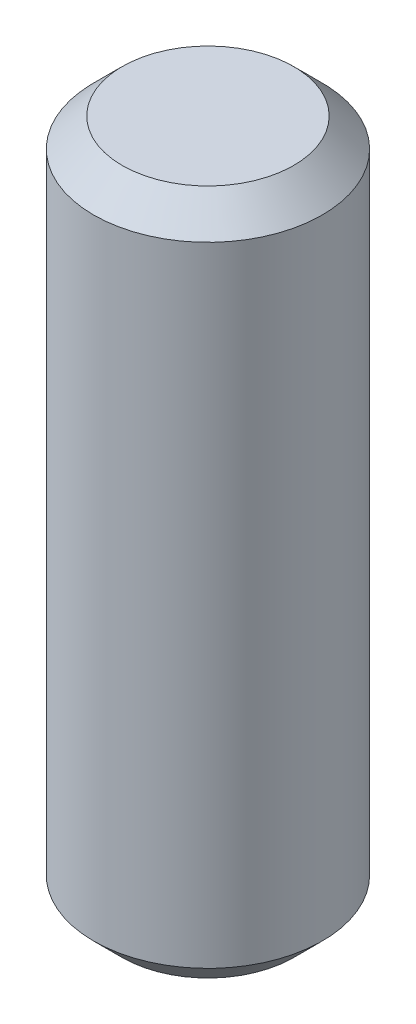
ISO-10303-21;
HEADER;
FILE_DESCRIPTION(('STEP AP214'),'2;1');
FILE_NAME('part.step','',(''),(''),'','','');
FILE_SCHEMA(('AUTOMOTIVE_DESIGN { 1 0 10303 214 1 1 1 1 }'));
ENDSEC;
DATA;
#1=APPLICATION_CONTEXT('core data for automotive mechanical design processes');
#2=APPLICATION_PROTOCOL_DEFINITION('international standard','automotive_design',2000,#1);
#3=PRODUCT_CONTEXT('',#1,'mechanical');
#4=PRODUCT('Part','Part','',(#3));
#5=PRODUCT_RELATED_PRODUCT_CATEGORY('part','',(#4));
#6=PRODUCT_DEFINITION_FORMATION('','',#4);
#7=PRODUCT_DEFINITION_CONTEXT('part definition',#1,'design');
#8=PRODUCT_DEFINITION('design','',#6,#7);
#9=PRODUCT_DEFINITION_SHAPE('','',#8);
#10=(LENGTH_UNIT() NAMED_UNIT(*) SI_UNIT(.MILLI.,.METRE.));
#11=(NAMED_UNIT(*) PLANE_ANGLE_UNIT() SI_UNIT($,.RADIAN.));
#12=(NAMED_UNIT(*) SI_UNIT($,.STERADIAN.) SOLID_ANGLE_UNIT());
#13=UNCERTAINTY_MEASURE_WITH_UNIT(LENGTH_MEASURE(1.E-05),#10,'distance_accuracy_value','');
#14=(GEOMETRIC_REPRESENTATION_CONTEXT(3) GLOBAL_UNCERTAINTY_ASSIGNED_CONTEXT((#13)) GLOBAL_UNIT_ASSIGNED_CONTEXT((#10,
#11,#12)) REPRESENTATION_CONTEXT('',''));
#15=CARTESIAN_POINT('',(0.,0.,0.));
#16=DIRECTION('',(0.,0.,1.));
#17=DIRECTION('',(1.,0.,0.));
#18=AXIS2_PLACEMENT_3D('',#15,#16,#17);
#19=CARTESIAN_POINT('',(0.,6.,0.));
#20=DIRECTION('',(0.,-1.,0.));
#21=DIRECTION('',(0.,0.,-1.));
#22=AXIS2_PLACEMENT_3D('',#19,#20,#21);
#23=CYLINDRICAL_SURFACE('',#22,1.);
#24=CARTESIAN_POINT('',(0.,0.250000000000001,0.));
#25=DIRECTION('',(0.,1.,0.));
#26=DIRECTION('',(0.,0.,1.));
#27=AXIS2_PLACEMENT_3D('',#24,#25,#26);
#28=CIRCLE('',#27,1.);
#29=CARTESIAN_POINT('',(0.,0.250000000000001,1.));
#30=VERTEX_POINT('',#29);
#31=EDGE_CURVE('E50',#30,#30,#28,.T.);
#32=ORIENTED_EDGE('',*,*,#31,.T.);
#33=EDGE_LOOP('',(#32));
#34=FACE_BOUND('',#33,.T.);
#35=CARTESIAN_POINT('',(0.,5.75,0.));
#36=DIRECTION('',(0.,1.,0.));
#37=DIRECTION('',(0.,0.,1.));
#38=AXIS2_PLACEMENT_3D('',#35,#36,#37);
#39=CIRCLE('',#38,1.);
#40=CARTESIAN_POINT('',(0.,5.75,1.));
#41=VERTEX_POINT('',#40);
#42=EDGE_CURVE('E55',#41,#41,#39,.F.);
#43=ORIENTED_EDGE('',*,*,#42,.T.);
#44=EDGE_LOOP('',(#43));
#45=FACE_BOUND('',#44,.T.);
#46=ADVANCED_FACE('F37',(#34,#45),#23,.T.);
#47=CARTESIAN_POINT('',(0.,6.,0.));
#48=DIRECTION('',(0.,1.,0.));
#49=DIRECTION('',(0.,0.,1.));
#50=AXIS2_PLACEMENT_3D('',#47,#48,#49);
#51=PLANE('',#50);
#52=CARTESIAN_POINT('',(0.,6.,0.));
#53=DIRECTION('',(0.,1.,0.));
#54=DIRECTION('',(0.,0.,1.));
#55=AXIS2_PLACEMENT_3D('',#52,#53,#54);
#56=CIRCLE('',#55,0.749999999999999);
#57=CARTESIAN_POINT('',(0.,6.,0.749999999999999));
#58=VERTEX_POINT('',#57);
#59=EDGE_CURVE('E10',#58,#58,#56,.T.);
#60=ORIENTED_EDGE('',*,*,#59,.T.);
#61=EDGE_LOOP('',(#60));
#62=FACE_BOUND('',#61,.T.);
#63=ADVANCED_FACE('F71',(#62),#51,.T.);
#64=CARTESIAN_POINT('',(0.,0.,0.));
#65=DIRECTION('',(0.,1.,0.));
#66=DIRECTION('',(0.,0.,1.));
#67=AXIS2_PLACEMENT_3D('',#64,#65,#66);
#68=PLANE('',#67);
#69=CARTESIAN_POINT('',(0.,0.,0.));
#70=DIRECTION('',(0.,1.,0.));
#71=DIRECTION('',(0.,0.,1.));
#72=AXIS2_PLACEMENT_3D('',#69,#70,#71);
#73=CIRCLE('',#72,0.749999999999998);
#74=CARTESIAN_POINT('',(0.,0.,0.749999999999998));
#75=VERTEX_POINT('',#74);
#76=EDGE_CURVE('E45',#75,#75,#73,.F.);
#77=ORIENTED_EDGE('',*,*,#76,.T.);
#78=EDGE_LOOP('',(#77));
#79=FACE_BOUND('',#78,.T.);
#80=ADVANCED_FACE('F68',(#79),#68,.F.);
#81=CARTESIAN_POINT('',(0.,0.250000000000001,0.));
#82=DIRECTION('',(0.,1.,0.));
#83=DIRECTION('',(0.,0.,1.));
#84=AXIS2_PLACEMENT_3D('',#81,#82,#83);
#85=CONICAL_SURFACE('',#84,1.,0.78539816339745);
#86=ORIENTED_EDGE('',*,*,#76,.F.);
#87=EDGE_LOOP('',(#86));
#88=FACE_BOUND('',#87,.T.);
#89=ORIENTED_EDGE('',*,*,#31,.F.);
#90=EDGE_LOOP('',(#89));
#91=FACE_BOUND('',#90,.T.);
#92=ADVANCED_FACE('F64',(#88,#91),#85,.T.);
#93=CARTESIAN_POINT('',(0.,6.,0.));
#94=DIRECTION('',(0.,-1.,0.));
#95=DIRECTION('',(0.,0.,-1.));
#96=AXIS2_PLACEMENT_3D('',#93,#94,#95);
#97=CONICAL_SURFACE('',#96,0.749999999999999,0.785398163397447);
#98=ORIENTED_EDGE('',*,*,#42,.F.);
#99=EDGE_LOOP('',(#98));
#100=FACE_BOUND('',#99,.T.);
#101=ORIENTED_EDGE('',*,*,#59,.F.);
#102=EDGE_LOOP('',(#101));
#103=FACE_BOUND('',#102,.T.);
#104=ADVANCED_FACE('F40',(#100,#103),#97,.T.);
#105=CLOSED_SHELL('',(#46,#63,#80,#92,#104));
#106=MANIFOLD_SOLID_BREP('B2',#105);
#107=ADVANCED_BREP_SHAPE_REPRESENTATION('',(#18,#106),#14);
#108=SHAPE_DEFINITION_REPRESENTATION(#9,#107);
ENDSEC;
END-ISO-10303-21;
